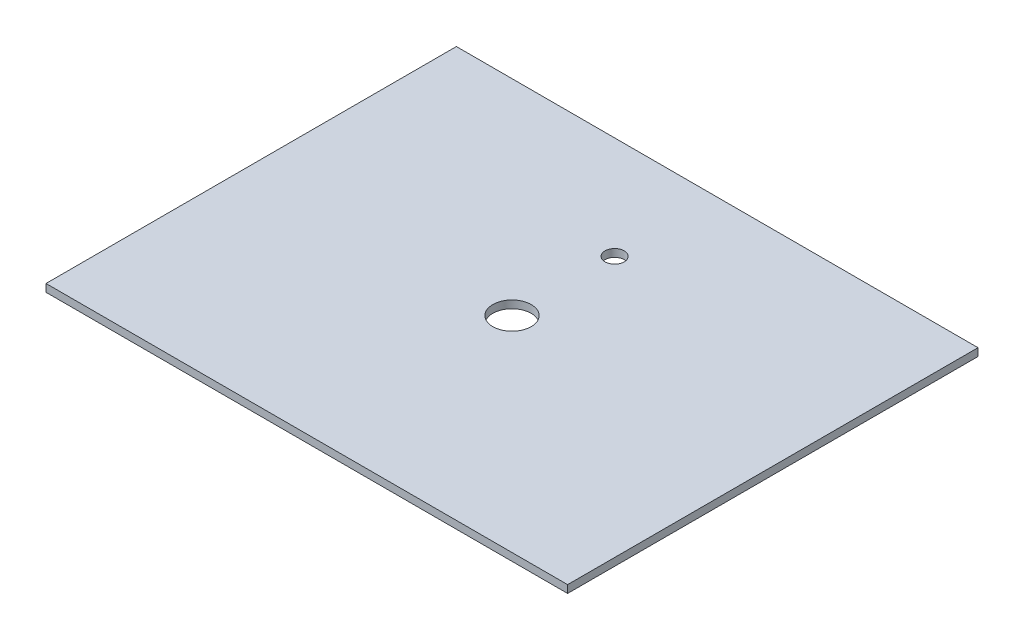
ISO-10303-21;
HEADER;
FILE_DESCRIPTION(('STEP AP214'),'2;1');
FILE_NAME('part.step','',(''),(''),'','','');
FILE_SCHEMA(('AUTOMOTIVE_DESIGN { 1 0 10303 214 1 1 1 1 }'));
ENDSEC;
DATA;
#1=APPLICATION_CONTEXT('core data for automotive mechanical design processes');
#2=APPLICATION_PROTOCOL_DEFINITION('international standard','automotive_design',2000,#1);
#3=PRODUCT_CONTEXT('',#1,'mechanical');
#4=PRODUCT('Part','Part','',(#3));
#5=PRODUCT_RELATED_PRODUCT_CATEGORY('part','',(#4));
#6=PRODUCT_DEFINITION_FORMATION('','',#4);
#7=PRODUCT_DEFINITION_CONTEXT('part definition',#1,'design');
#8=PRODUCT_DEFINITION('design','',#6,#7);
#9=PRODUCT_DEFINITION_SHAPE('','',#8);
#10=(LENGTH_UNIT() NAMED_UNIT(*) SI_UNIT(.MILLI.,.METRE.));
#11=(NAMED_UNIT(*) PLANE_ANGLE_UNIT() SI_UNIT($,.RADIAN.));
#12=(NAMED_UNIT(*) SI_UNIT($,.STERADIAN.) SOLID_ANGLE_UNIT());
#13=UNCERTAINTY_MEASURE_WITH_UNIT(LENGTH_MEASURE(1.E-05),#10,'distance_accuracy_value','');
#14=(GEOMETRIC_REPRESENTATION_CONTEXT(3) GLOBAL_UNCERTAINTY_ASSIGNED_CONTEXT((#13)) GLOBAL_UNIT_ASSIGNED_CONTEXT((#10,
#11,#12)) REPRESENTATION_CONTEXT('',''));
#15=CARTESIAN_POINT('',(0.,0.,0.));
#16=DIRECTION('',(0.,0.,1.));
#17=DIRECTION('',(1.,0.,0.));
#18=AXIS2_PLACEMENT_3D('',#15,#16,#17);
#19=CARTESIAN_POINT('',(0.,10.,0.));
#20=DIRECTION('',(0.,1.,0.));
#21=DIRECTION('',(0.,0.,1.));
#22=AXIS2_PLACEMENT_3D('',#19,#20,#21);
#23=PLANE('',#22);
#24=CARTESIAN_POINT('',(1.11022302462516E-13,10.,-1.66533453693773E-13));
#25=DIRECTION('',(0.,1.,0.));
#26=DIRECTION('',(0.,0.,1.));
#27=AXIS2_PLACEMENT_3D('',#24,#25,#26);
#28=CIRCLE('',#27,25.);
#29=CARTESIAN_POINT('',(1.11022302462516E-13,10.,24.9999999999998));
#30=VERTEX_POINT('',#29);
#31=EDGE_CURVE('E112',#30,#30,#28,.T.);
#32=ORIENTED_EDGE('',*,*,#31,.F.);
#33=EDGE_LOOP('',(#32));
#34=FACE_BOUND('',#33,.T.);
#35=DIRECTION('',(0.,0.,-1.));
#36=VECTOR('',#35,1.);
#37=CARTESIAN_POINT('',(340.,10.,-267.5));
#38=LINE('',#37,#36);
#39=CARTESIAN_POINT('',(340.,10.,267.5));
#40=VERTEX_POINT('',#39);
#41=CARTESIAN_POINT('',(340.,10.,-267.5));
#42=VERTEX_POINT('',#41);
#43=EDGE_CURVE('E92',#40,#42,#38,.T.);
#44=ORIENTED_EDGE('',*,*,#43,.T.);
#45=DIRECTION('',(-1.,0.,0.));
#46=VECTOR('',#45,1.);
#47=CARTESIAN_POINT('',(-340.,10.,-267.5));
#48=LINE('',#47,#46);
#49=CARTESIAN_POINT('',(-340.,10.,-267.5));
#50=VERTEX_POINT('',#49);
#51=EDGE_CURVE('E87',#42,#50,#48,.T.);
#52=ORIENTED_EDGE('',*,*,#51,.T.);
#53=DIRECTION('',(0.,0.,1.));
#54=VECTOR('',#53,1.);
#55=CARTESIAN_POINT('',(-340.,10.,-267.5));
#56=LINE('',#55,#54);
#57=CARTESIAN_POINT('',(-340.,10.,267.5));
#58=VERTEX_POINT('',#57);
#59=EDGE_CURVE('E90',#50,#58,#56,.T.);
#60=ORIENTED_EDGE('',*,*,#59,.T.);
#61=DIRECTION('',(1.,0.,0.));
#62=VECTOR('',#61,1.);
#63=CARTESIAN_POINT('',(-340.,10.,267.5));
#64=LINE('',#63,#62);
#65=EDGE_CURVE('E57',#58,#40,#64,.T.);
#66=ORIENTED_EDGE('',*,*,#65,.T.);
#67=EDGE_LOOP('',(#44,#52,#60,#66));
#68=FACE_BOUND('',#67,.T.);
#69=CARTESIAN_POINT('',(1.11022302462516E-13,10.,-133.75));
#70=DIRECTION('',(0.,1.,0.));
#71=DIRECTION('',(0.,0.,1.));
#72=AXIS2_PLACEMENT_3D('',#69,#70,#71);
#73=CIRCLE('',#72,12.5);
#74=CARTESIAN_POINT('',(1.11022302462516E-13,10.,-121.25));
#75=VERTEX_POINT('',#74);
#76=EDGE_CURVE('E134',#75,#75,#73,.T.);
#77=ORIENTED_EDGE('',*,*,#76,.F.);
#78=EDGE_LOOP('',(#77));
#79=FACE_BOUND('',#78,.T.);
#80=ADVANCED_FACE('F39',(#34,#68,#79),#23,.T.);
#81=CARTESIAN_POINT('',(0.,0.,0.));
#82=DIRECTION('',(0.,1.,0.));
#83=DIRECTION('',(0.,0.,1.));
#84=AXIS2_PLACEMENT_3D('',#81,#82,#83);
#85=PLANE('',#84);
#86=DIRECTION('',(0.,0.,-1.));
#87=VECTOR('',#86,1.);
#88=CARTESIAN_POINT('',(340.,0.,-267.5));
#89=LINE('',#88,#87);
#90=CARTESIAN_POINT('',(340.,0.,267.5));
#91=VERTEX_POINT('',#90);
#92=CARTESIAN_POINT('',(340.,0.,-267.5));
#93=VERTEX_POINT('',#92);
#94=EDGE_CURVE('E108',#91,#93,#89,.T.);
#95=ORIENTED_EDGE('',*,*,#94,.F.);
#96=DIRECTION('',(1.,0.,0.));
#97=VECTOR('',#96,1.);
#98=CARTESIAN_POINT('',(-340.,0.,267.5));
#99=LINE('',#98,#97);
#100=CARTESIAN_POINT('',(-340.,0.,267.5));
#101=VERTEX_POINT('',#100);
#102=EDGE_CURVE('E80',#101,#91,#99,.T.);
#103=ORIENTED_EDGE('',*,*,#102,.F.);
#104=DIRECTION('',(0.,0.,1.));
#105=VECTOR('',#104,1.);
#106=CARTESIAN_POINT('',(-340.,0.,-267.5));
#107=LINE('',#106,#105);
#108=CARTESIAN_POINT('',(-340.,0.,-267.5));
#109=VERTEX_POINT('',#108);
#110=EDGE_CURVE('E74',#109,#101,#107,.T.);
#111=ORIENTED_EDGE('',*,*,#110,.F.);
#112=DIRECTION('',(-1.,0.,0.));
#113=VECTOR('',#112,1.);
#114=CARTESIAN_POINT('',(-340.,0.,-267.5));
#115=LINE('',#114,#113);
#116=EDGE_CURVE('E97',#93,#109,#115,.T.);
#117=ORIENTED_EDGE('',*,*,#116,.F.);
#118=EDGE_LOOP('',(#95,#103,#111,#117));
#119=FACE_BOUND('',#118,.T.);
#120=CARTESIAN_POINT('',(1.11022302462516E-13,0.,-1.66533453693773E-13));
#121=DIRECTION('',(0.,1.,0.));
#122=DIRECTION('',(0.,0.,1.));
#123=AXIS2_PLACEMENT_3D('',#120,#121,#122);
#124=CIRCLE('',#123,25.);
#125=CARTESIAN_POINT('',(1.11022302462516E-13,0.,24.9999999999998));
#126=VERTEX_POINT('',#125);
#127=EDGE_CURVE('E130',#126,#126,#124,.T.);
#128=ORIENTED_EDGE('',*,*,#127,.T.);
#129=EDGE_LOOP('',(#128));
#130=FACE_BOUND('',#129,.T.);
#131=CARTESIAN_POINT('',(1.11022302462516E-13,0.,-133.75));
#132=DIRECTION('',(0.,1.,0.));
#133=DIRECTION('',(0.,0.,1.));
#134=AXIS2_PLACEMENT_3D('',#131,#132,#133);
#135=CIRCLE('',#134,12.5);
#136=CARTESIAN_POINT('',(1.11022302462516E-13,0.,-121.25));
#137=VERTEX_POINT('',#136);
#138=EDGE_CURVE('E138',#137,#137,#135,.T.);
#139=ORIENTED_EDGE('',*,*,#138,.T.);
#140=EDGE_LOOP('',(#139));
#141=FACE_BOUND('',#140,.T.);
#142=ADVANCED_FACE('F125',(#119,#130,#141),#85,.F.);
#143=CARTESIAN_POINT('',(340.,10.,-267.5));
#144=DIRECTION('',(-1.,0.,0.));
#145=DIRECTION('',(0.,0.,1.));
#146=AXIS2_PLACEMENT_3D('',#143,#144,#145);
#147=PLANE('',#146);
#148=ORIENTED_EDGE('',*,*,#94,.T.);
#149=DIRECTION('',(0.,-1.,0.));
#150=VECTOR('',#149,1.);
#151=CARTESIAN_POINT('',(340.,10.,-267.5));
#152=LINE('',#151,#150);
#153=EDGE_CURVE('E11',#42,#93,#152,.T.);
#154=ORIENTED_EDGE('',*,*,#153,.F.);
#155=ORIENTED_EDGE('',*,*,#43,.F.);
#156=DIRECTION('',(0.,-1.,0.));
#157=VECTOR('',#156,1.);
#158=CARTESIAN_POINT('',(340.,10.,267.5));
#159=LINE('',#158,#157);
#160=EDGE_CURVE('E104',#40,#91,#159,.T.);
#161=ORIENTED_EDGE('',*,*,#160,.T.);
#162=EDGE_LOOP('',(#148,#154,#155,#161));
#163=FACE_BOUND('',#162,.T.);
#164=ADVANCED_FACE('F41',(#163),#147,.F.);
#165=CARTESIAN_POINT('',(-340.,10.,-267.5));
#166=DIRECTION('',(0.,0.,1.));
#167=DIRECTION('',(1.,0.,0.));
#168=AXIS2_PLACEMENT_3D('',#165,#166,#167);
#169=PLANE('',#168);
#170=ORIENTED_EDGE('',*,*,#116,.T.);
#171=DIRECTION('',(0.,-1.,0.));
#172=VECTOR('',#171,1.);
#173=CARTESIAN_POINT('',(-340.,10.,-267.5));
#174=LINE('',#173,#172);
#175=EDGE_CURVE('E49',#50,#109,#174,.T.);
#176=ORIENTED_EDGE('',*,*,#175,.F.);
#177=ORIENTED_EDGE('',*,*,#51,.F.);
#178=ORIENTED_EDGE('',*,*,#153,.T.);
#179=EDGE_LOOP('',(#170,#176,#177,#178));
#180=FACE_BOUND('',#179,.T.);
#181=ADVANCED_FACE('F96',(#180),#169,.F.);
#182=CARTESIAN_POINT('',(-340.,10.,-267.5));
#183=DIRECTION('',(1.,0.,0.));
#184=DIRECTION('',(0.,0.,-1.));
#185=AXIS2_PLACEMENT_3D('',#182,#183,#184);
#186=PLANE('',#185);
#187=ORIENTED_EDGE('',*,*,#110,.T.);
#188=DIRECTION('',(0.,-1.,0.));
#189=VECTOR('',#188,1.);
#190=CARTESIAN_POINT('',(-340.,10.,267.5));
#191=LINE('',#190,#189);
#192=EDGE_CURVE('E99',#58,#101,#191,.T.);
#193=ORIENTED_EDGE('',*,*,#192,.F.);
#194=ORIENTED_EDGE('',*,*,#59,.F.);
#195=ORIENTED_EDGE('',*,*,#175,.T.);
#196=EDGE_LOOP('',(#187,#193,#194,#195));
#197=FACE_BOUND('',#196,.T.);
#198=ADVANCED_FACE('F100',(#197),#186,.F.);
#199=CARTESIAN_POINT('',(-340.,10.,267.5));
#200=DIRECTION('',(0.,0.,-1.));
#201=DIRECTION('',(-1.,0.,0.));
#202=AXIS2_PLACEMENT_3D('',#199,#200,#201);
#203=PLANE('',#202);
#204=ORIENTED_EDGE('',*,*,#102,.T.);
#205=ORIENTED_EDGE('',*,*,#160,.F.);
#206=ORIENTED_EDGE('',*,*,#65,.F.);
#207=ORIENTED_EDGE('',*,*,#192,.T.);
#208=EDGE_LOOP('',(#204,#205,#206,#207));
#209=FACE_BOUND('',#208,.T.);
#210=ADVANCED_FACE('F122',(#209),#203,.F.);
#211=CARTESIAN_POINT('',(1.11022302462516E-13,10.,-1.66533453693773E-13));
#212=DIRECTION('',(0.,-1.,0.));
#213=DIRECTION('',(0.,0.,-1.));
#214=AXIS2_PLACEMENT_3D('',#211,#212,#213);
#215=CYLINDRICAL_SURFACE('',#214,25.);
#216=ORIENTED_EDGE('',*,*,#31,.T.);
#217=EDGE_LOOP('',(#216));
#218=FACE_BOUND('',#217,.T.);
#219=ORIENTED_EDGE('',*,*,#127,.F.);
#220=EDGE_LOOP('',(#219));
#221=FACE_BOUND('',#220,.T.);
#222=ADVANCED_FACE('F157',(#218,#221),#215,.F.);
#223=CARTESIAN_POINT('',(1.11022302462516E-13,10.,-133.75));
#224=DIRECTION('',(0.,-1.,0.));
#225=DIRECTION('',(0.,0.,-1.));
#226=AXIS2_PLACEMENT_3D('',#223,#224,#225);
#227=CYLINDRICAL_SURFACE('',#226,12.5);
#228=ORIENTED_EDGE('',*,*,#76,.T.);
#229=EDGE_LOOP('',(#228));
#230=FACE_BOUND('',#229,.T.);
#231=ORIENTED_EDGE('',*,*,#138,.F.);
#232=EDGE_LOOP('',(#231));
#233=FACE_BOUND('',#232,.T.);
#234=ADVANCED_FACE('F146',(#230,#233),#227,.F.);
#235=CLOSED_SHELL('',(#80,#142,#164,#181,#198,#210,#222,#234));
#236=MANIFOLD_SOLID_BREP('B2',#235);
#237=ADVANCED_BREP_SHAPE_REPRESENTATION('',(#18,#236),#14);
#238=SHAPE_DEFINITION_REPRESENTATION(#9,#237);
ENDSEC;
END-ISO-10303-21;
